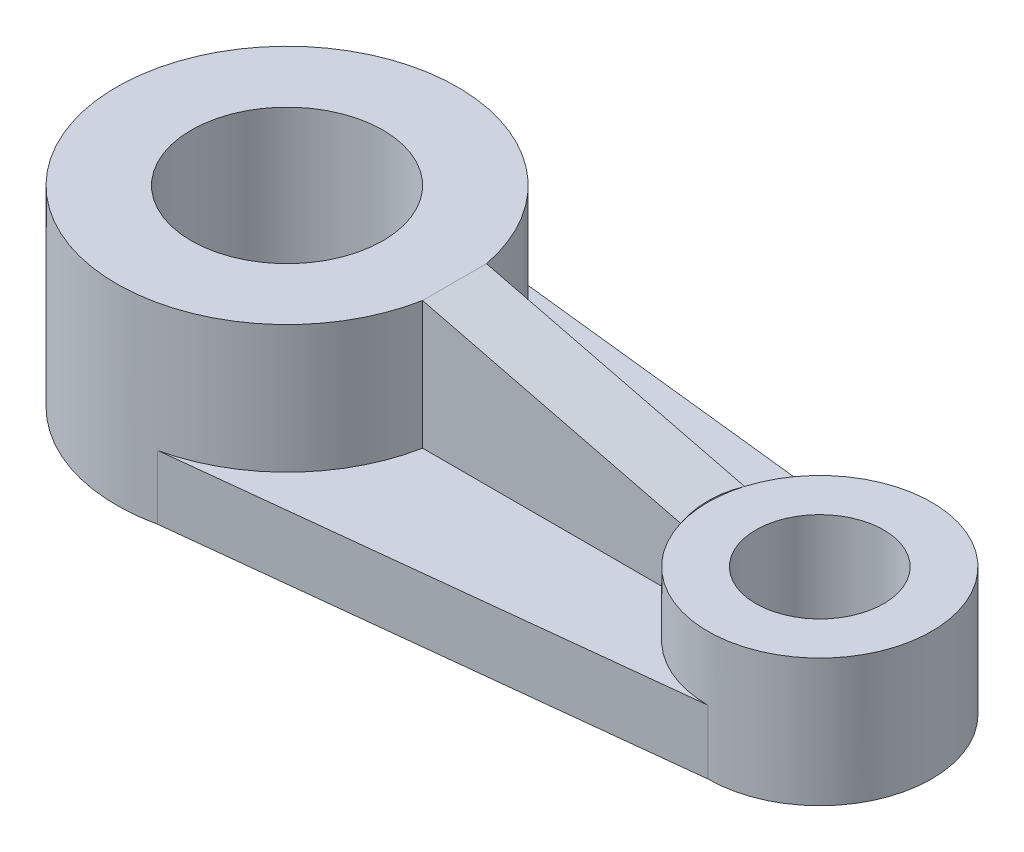
ISO-10303-21;
HEADER;
FILE_DESCRIPTION(('STEP AP214'),'2;1');
FILE_NAME('part.step','',(''),(''),'','','');
FILE_SCHEMA(('AUTOMOTIVE_DESIGN { 1 0 10303 214 1 1 1 1 }'));
ENDSEC;
DATA;
#1=APPLICATION_CONTEXT('core data for automotive mechanical design processes');
#2=APPLICATION_PROTOCOL_DEFINITION('international standard','automotive_design',2000,#1);
#3=PRODUCT_CONTEXT('',#1,'mechanical');
#4=PRODUCT('Part','Part','',(#3));
#5=PRODUCT_RELATED_PRODUCT_CATEGORY('part','',(#4));
#6=PRODUCT_DEFINITION_FORMATION('','',#4);
#7=PRODUCT_DEFINITION_CONTEXT('part definition',#1,'design');
#8=PRODUCT_DEFINITION('design','',#6,#7);
#9=PRODUCT_DEFINITION_SHAPE('','',#8);
#10=(LENGTH_UNIT() NAMED_UNIT(*) SI_UNIT(.MILLI.,.METRE.));
#11=(NAMED_UNIT(*) PLANE_ANGLE_UNIT() SI_UNIT($,.RADIAN.));
#12=(NAMED_UNIT(*) SI_UNIT($,.STERADIAN.) SOLID_ANGLE_UNIT());
#13=UNCERTAINTY_MEASURE_WITH_UNIT(LENGTH_MEASURE(1.E-05),#10,'distance_accuracy_value','');
#14=(GEOMETRIC_REPRESENTATION_CONTEXT(3) GLOBAL_UNCERTAINTY_ASSIGNED_CONTEXT((#13)) GLOBAL_UNIT_ASSIGNED_CONTEXT((#10,
#11,#12)) REPRESENTATION_CONTEXT('',''));
#15=CARTESIAN_POINT('',(0.,0.,0.));
#16=DIRECTION('',(0.,0.,1.));
#17=DIRECTION('',(1.,0.,0.));
#18=AXIS2_PLACEMENT_3D('',#15,#16,#17);
#19=CARTESIAN_POINT('',(0.,36.,0.));
#20=DIRECTION('',(0.,-1.,0.));
#21=DIRECTION('',(0.,0.,-1.));
#22=AXIS2_PLACEMENT_3D('',#19,#20,#21);
#23=CYLINDRICAL_SURFACE('',#22,32.);
#24=DIRECTION('',(0.,-1.,0.));
#25=VECTOR('',#24,1.);
#26=CARTESIAN_POINT('',(31.4324672910034,36.,6.));
#27=LINE('',#26,#25);
#28=CARTESIAN_POINT('',(31.4324672910034,36.,6.));
#29=VERTEX_POINT('',#28);
#30=CARTESIAN_POINT('',(31.4324672910034,12.,6.));
#31=VERTEX_POINT('',#30);
#32=EDGE_CURVE('E120',#29,#31,#27,.T.);
#33=ORIENTED_EDGE('',*,*,#32,.F.);
#34=CARTESIAN_POINT('',(0.,36.,0.));
#35=DIRECTION('',(0.,1.,0.));
#36=DIRECTION('',(0.,0.,1.));
#37=AXIS2_PLACEMENT_3D('',#34,#35,#36);
#38=CIRCLE('',#37,32.);
#39=CARTESIAN_POINT('',(31.4324672910034,36.,-6.));
#40=VERTEX_POINT('',#39);
#41=EDGE_CURVE('E127',#40,#29,#38,.T.);
#42=ORIENTED_EDGE('',*,*,#41,.F.);
#43=DIRECTION('',(0.,-1.,0.));
#44=VECTOR('',#43,1.);
#45=CARTESIAN_POINT('',(31.4324672910034,36.,-6.));
#46=LINE('',#45,#44);
#47=CARTESIAN_POINT('',(31.4324672910034,12.,-6.));
#48=VERTEX_POINT('',#47);
#49=EDGE_CURVE('E131',#40,#48,#46,.T.);
#50=ORIENTED_EDGE('',*,*,#49,.T.);
#51=CARTESIAN_POINT('',(0.,12.,0.));
#52=DIRECTION('',(0.,1.,0.));
#53=DIRECTION('',(0.,0.,1.));
#54=AXIS2_PLACEMENT_3D('',#51,#52,#53);
#55=CIRCLE('',#54,32.);
#56=CARTESIAN_POINT('',(6.95583440371503,12.,-31.2348582155914));
#57=VERTEX_POINT('',#56);
#58=EDGE_CURVE('E66',#48,#57,#55,.T.);
#59=ORIENTED_EDGE('',*,*,#58,.T.);
#60=DIRECTION('',(0.,-1.,0.));
#61=VECTOR('',#60,1.);
#62=CARTESIAN_POINT('',(6.95583440371503,12.,-31.2348582155914));
#63=LINE('',#62,#61);
#64=CARTESIAN_POINT('',(6.95583440371503,0.,-31.2348582155914));
#65=VERTEX_POINT('',#64);
#66=EDGE_CURVE('E150',#57,#65,#63,.T.);
#67=ORIENTED_EDGE('',*,*,#66,.T.);
#68=CARTESIAN_POINT('',(0.,0.,0.));
#69=DIRECTION('',(0.,1.,0.));
#70=DIRECTION('',(0.,0.,1.));
#71=AXIS2_PLACEMENT_3D('',#68,#69,#70);
#72=CIRCLE('',#71,32.);
#73=CARTESIAN_POINT('',(6.95583440371503,0.,31.2348582155914));
#74=VERTEX_POINT('',#73);
#75=EDGE_CURVE('E136',#65,#74,#72,.T.);
#76=ORIENTED_EDGE('',*,*,#75,.T.);
#77=DIRECTION('',(0.,-1.,0.));
#78=VECTOR('',#77,1.);
#79=CARTESIAN_POINT('',(6.95583440371503,12.,31.2348582155914));
#80=LINE('',#79,#78);
#81=CARTESIAN_POINT('',(6.95583440371503,12.,31.2348582155914));
#82=VERTEX_POINT('',#81);
#83=EDGE_CURVE('E152',#82,#74,#80,.T.);
#84=ORIENTED_EDGE('',*,*,#83,.F.);
#85=EDGE_CURVE('E129',#82,#31,#55,.T.);
#86=ORIENTED_EDGE('',*,*,#85,.T.);
#87=EDGE_LOOP('',(#33,#42,#50,#59,#67,#76,#84,#86));
#88=FACE_BOUND('',#87,.T.);
#89=ADVANCED_FACE('F45',(#88),#23,.T.);
#90=CARTESIAN_POINT('',(0.,12.,0.));
#91=DIRECTION('',(0.,1.,0.));
#92=DIRECTION('',(0.,0.,1.));
#93=AXIS2_PLACEMENT_3D('',#90,#91,#92);
#94=PLANE('',#93);
#95=CARTESIAN_POINT('',(100.,12.,0.));
#96=DIRECTION('',(0.,1.,0.));
#97=DIRECTION('',(0.,0.,1.));
#98=AXIS2_PLACEMENT_3D('',#95,#96,#97);
#99=CIRCLE('',#98,21.);
#100=CARTESIAN_POINT('',(79.8753882025019,12.,6.));
#101=VERTEX_POINT('',#100);
#102=CARTESIAN_POINT('',(100.,12.,21.));
#103=VERTEX_POINT('',#102);
#104=EDGE_CURVE('E161',#101,#103,#99,.T.);
#105=ORIENTED_EDGE('',*,*,#104,.F.);
#106=DIRECTION('',(-1.,0.,0.));
#107=VECTOR('',#106,1.);
#108=CARTESIAN_POINT('',(0.,12.,6.));
#109=LINE('',#108,#107);
#110=EDGE_CURVE('E185',#101,#31,#109,.T.);
#111=ORIENTED_EDGE('',*,*,#110,.T.);
#112=ORIENTED_EDGE('',*,*,#85,.F.);
#113=DIRECTION('',(0.994004355935433,0.,-0.109340479152898));
#114=VECTOR('',#113,1.);
#115=CARTESIAN_POINT('',(3.47791720185752,12.,31.6174291077957));
#116=LINE('',#115,#114);
#117=EDGE_CURVE('E158',#82,#103,#116,.T.);
#118=ORIENTED_EDGE('',*,*,#117,.T.);
#119=EDGE_LOOP('',(#105,#111,#112,#118));
#120=FACE_BOUND('',#119,.T.);
#121=ADVANCED_FACE('F213',(#120),#94,.T.);
#122=CARTESIAN_POINT('',(100.,24.,0.));
#123=DIRECTION('',(0.,-1.,0.));
#124=DIRECTION('',(0.,0.,-1.));
#125=AXIS2_PLACEMENT_3D('',#122,#123,#124);
#126=CYLINDRICAL_SURFACE('',#125,21.);
#127=DIRECTION('',(0.,-1.,0.));
#128=VECTOR('',#127,1.);
#129=CARTESIAN_POINT('',(79.8753882025019,24.,6.));
#130=LINE('',#129,#128);
#131=CARTESIAN_POINT('',(79.8753882025019,24.,6.));
#132=VERTEX_POINT('',#131);
#133=EDGE_CURVE('E52',#101,#132,#130,.F.);
#134=ORIENTED_EDGE('',*,*,#133,.F.);
#135=ORIENTED_EDGE('',*,*,#104,.T.);
#136=DIRECTION('',(0.,-1.,0.));
#137=VECTOR('',#136,1.);
#138=CARTESIAN_POINT('',(100.,12.,21.));
#139=LINE('',#138,#137);
#140=CARTESIAN_POINT('',(100.,0.,21.));
#141=VERTEX_POINT('',#140);
#142=EDGE_CURVE('E155',#103,#141,#139,.T.);
#143=ORIENTED_EDGE('',*,*,#142,.T.);
#144=CARTESIAN_POINT('',(100.,0.,0.));
#145=DIRECTION('',(0.,1.,0.));
#146=DIRECTION('',(0.,0.,1.));
#147=AXIS2_PLACEMENT_3D('',#144,#145,#146);
#148=CIRCLE('',#147,21.);
#149=CARTESIAN_POINT('',(100.,0.,-21.));
#150=VERTEX_POINT('',#149);
#151=EDGE_CURVE('E175',#141,#150,#148,.T.);
#152=ORIENTED_EDGE('',*,*,#151,.T.);
#153=DIRECTION('',(0.,-1.,0.));
#154=VECTOR('',#153,1.);
#155=CARTESIAN_POINT('',(100.,12.,-21.));
#156=LINE('',#155,#154);
#157=CARTESIAN_POINT('',(100.,12.,-21.));
#158=VERTEX_POINT('',#157);
#159=EDGE_CURVE('E146',#158,#150,#156,.T.);
#160=ORIENTED_EDGE('',*,*,#159,.F.);
#161=CARTESIAN_POINT('',(79.8753882025019,12.,-6.));
#162=VERTEX_POINT('',#161);
#163=EDGE_CURVE('E172',#158,#162,#99,.T.);
#164=ORIENTED_EDGE('',*,*,#163,.T.);
#165=DIRECTION('',(0.,-1.,0.));
#166=VECTOR('',#165,1.);
#167=CARTESIAN_POINT('',(79.8753882025019,24.,-6.));
#168=LINE('',#167,#166);
#169=CARTESIAN_POINT('',(79.8753882025019,24.,-6.));
#170=VERTEX_POINT('',#169);
#171=EDGE_CURVE('E135',#162,#170,#168,.F.);
#172=ORIENTED_EDGE('',*,*,#171,.T.);
#173=CARTESIAN_POINT('',(100.,24.,0.));
#174=DIRECTION('',(0.,1.,0.));
#175=DIRECTION('',(0.,0.,1.));
#176=AXIS2_PLACEMENT_3D('',#173,#174,#175);
#177=CIRCLE('',#176,21.);
#178=EDGE_CURVE('E178',#132,#170,#177,.T.);
#179=ORIENTED_EDGE('',*,*,#178,.F.);
#180=EDGE_LOOP('',(#134,#135,#143,#152,#160,#164,#172,#179));
#181=FACE_BOUND('',#180,.T.);
#182=ADVANCED_FACE('F201',(#181),#126,.T.);
#183=CARTESIAN_POINT('',(0.,36.,0.));
#184=DIRECTION('',(0.,1.,0.));
#185=DIRECTION('',(0.,0.,1.));
#186=AXIS2_PLACEMENT_3D('',#183,#184,#185);
#187=PLANE('',#186);
#188=DIRECTION('',(0.,0.,1.));
#189=VECTOR('',#188,1.);
#190=CARTESIAN_POINT('',(31.4324672910034,36.,-26.));
#191=LINE('',#190,#189);
#192=EDGE_CURVE('E108',#40,#29,#191,.T.);
#193=ORIENTED_EDGE('',*,*,#192,.F.);
#194=ORIENTED_EDGE('',*,*,#41,.T.);
#195=EDGE_LOOP('',(#193,#194));
#196=FACE_BOUND('',#195,.T.);
#197=CARTESIAN_POINT('',(0.,36.,0.));
#198=DIRECTION('',(0.,1.,0.));
#199=DIRECTION('',(0.,0.,1.));
#200=AXIS2_PLACEMENT_3D('',#197,#198,#199);
#201=CIRCLE('',#200,18.);
#202=CARTESIAN_POINT('',(0.,36.,18.));
#203=VERTEX_POINT('',#202);
#204=EDGE_CURVE('E140',#203,#203,#201,.T.);
#205=ORIENTED_EDGE('',*,*,#204,.F.);
#206=EDGE_LOOP('',(#205));
#207=FACE_BOUND('',#206,.T.);
#208=ADVANCED_FACE('F133',(#196,#207),#187,.T.);
#209=CARTESIAN_POINT('',(0.,0.,0.));
#210=DIRECTION('',(0.,1.,0.));
#211=DIRECTION('',(0.,0.,1.));
#212=AXIS2_PLACEMENT_3D('',#209,#210,#211);
#213=PLANE('',#212);
#214=ORIENTED_EDGE('',*,*,#75,.F.);
#215=DIRECTION('',(0.994004355935433,0.,0.109340479152898));
#216=VECTOR('',#215,1.);
#217=CARTESIAN_POINT('',(3.47791720185752,0.,-31.6174291077957));
#218=LINE('',#217,#216);
#219=EDGE_CURVE('E162',#65,#150,#218,.T.);
#220=ORIENTED_EDGE('',*,*,#219,.T.);
#221=ORIENTED_EDGE('',*,*,#151,.F.);
#222=DIRECTION('',(0.994004355935433,0.,-0.109340479152898));
#223=VECTOR('',#222,1.);
#224=CARTESIAN_POINT('',(3.47791720185752,0.,31.6174291077957));
#225=LINE('',#224,#223);
#226=EDGE_CURVE('E159',#74,#141,#225,.T.);
#227=ORIENTED_EDGE('',*,*,#226,.F.);
#228=EDGE_LOOP('',(#214,#220,#221,#227));
#229=FACE_BOUND('',#228,.T.);
#230=CARTESIAN_POINT('',(0.,0.,0.));
#231=DIRECTION('',(0.,1.,0.));
#232=DIRECTION('',(0.,0.,1.));
#233=AXIS2_PLACEMENT_3D('',#230,#231,#232);
#234=CIRCLE('',#233,18.);
#235=CARTESIAN_POINT('',(0.,0.,18.));
#236=VERTEX_POINT('',#235);
#237=EDGE_CURVE('E143',#236,#236,#234,.T.);
#238=ORIENTED_EDGE('',*,*,#237,.T.);
#239=EDGE_LOOP('',(#238));
#240=FACE_BOUND('',#239,.T.);
#241=CARTESIAN_POINT('',(100.,0.,0.));
#242=DIRECTION('',(0.,1.,0.));
#243=DIRECTION('',(0.,0.,1.));
#244=AXIS2_PLACEMENT_3D('',#241,#242,#243);
#245=CIRCLE('',#244,12.);
#246=CARTESIAN_POINT('',(100.,0.,12.));
#247=VERTEX_POINT('',#246);
#248=EDGE_CURVE('E182',#247,#247,#245,.T.);
#249=ORIENTED_EDGE('',*,*,#248,.T.);
#250=EDGE_LOOP('',(#249));
#251=FACE_BOUND('',#250,.T.);
#252=ADVANCED_FACE('F206',(#229,#240,#251),#213,.F.);
#253=CARTESIAN_POINT('',(0.,36.,0.));
#254=DIRECTION('',(0.,-1.,0.));
#255=DIRECTION('',(0.,0.,-1.));
#256=AXIS2_PLACEMENT_3D('',#253,#254,#255);
#257=CYLINDRICAL_SURFACE('',#256,18.);
#258=ORIENTED_EDGE('',*,*,#204,.T.);
#259=EDGE_LOOP('',(#258));
#260=FACE_BOUND('',#259,.T.);
#261=ORIENTED_EDGE('',*,*,#237,.F.);
#262=EDGE_LOOP('',(#261));
#263=FACE_BOUND('',#262,.T.);
#264=ADVANCED_FACE('F250',(#260,#263),#257,.F.);
#265=CARTESIAN_POINT('',(3.47791720185752,12.,-31.6174291077957));
#266=DIRECTION('',(0.109340479152898,0.,-0.994004355935433));
#267=DIRECTION('',(-0.994004355935433,0.,-0.109340479152898));
#268=AXIS2_PLACEMENT_3D('',#265,#266,#267);
#269=PLANE('',#268);
#270=ORIENTED_EDGE('',*,*,#219,.F.);
#271=ORIENTED_EDGE('',*,*,#66,.F.);
#272=DIRECTION('',(0.994004355935433,0.,0.109340479152898));
#273=VECTOR('',#272,1.);
#274=CARTESIAN_POINT('',(3.47791720185752,12.,-31.6174291077957));
#275=LINE('',#274,#273);
#276=EDGE_CURVE('E169',#57,#158,#275,.T.);
#277=ORIENTED_EDGE('',*,*,#276,.T.);
#278=ORIENTED_EDGE('',*,*,#159,.T.);
#279=EDGE_LOOP('',(#270,#271,#277,#278));
#280=FACE_BOUND('',#279,.T.);
#281=ADVANCED_FACE('F199',(#280),#269,.T.);
#282=CARTESIAN_POINT('',(3.47791720185752,12.,31.6174291077957));
#283=DIRECTION('',(-0.109340479152898,0.,-0.994004355935433));
#284=DIRECTION('',(-0.994004355935433,0.,0.109340479152898));
#285=AXIS2_PLACEMENT_3D('',#282,#283,#284);
#286=PLANE('',#285);
#287=ORIENTED_EDGE('',*,*,#226,.T.);
#288=ORIENTED_EDGE('',*,*,#142,.F.);
#289=ORIENTED_EDGE('',*,*,#117,.F.);
#290=ORIENTED_EDGE('',*,*,#83,.T.);
#291=EDGE_LOOP('',(#287,#288,#289,#290));
#292=FACE_BOUND('',#291,.T.);
#293=ADVANCED_FACE('F210',(#292),#286,.F.);
#294=DIRECTION('',(-1.,0.,0.));
#295=VECTOR('',#294,1.);
#296=CARTESIAN_POINT('',(0.,12.,-6.));
#297=LINE('',#296,#295);
#298=EDGE_CURVE('E130',#162,#48,#297,.T.);
#299=ORIENTED_EDGE('',*,*,#298,.F.);
#300=ORIENTED_EDGE('',*,*,#163,.F.);
#301=ORIENTED_EDGE('',*,*,#276,.F.);
#302=ORIENTED_EDGE('',*,*,#58,.F.);
#303=EDGE_LOOP('',(#299,#300,#301,#302));
#304=FACE_BOUND('',#303,.T.);
#305=ADVANCED_FACE('F195',(#304),#94,.T.);
#306=CARTESIAN_POINT('',(100.,24.,0.));
#307=DIRECTION('',(0.,1.,0.));
#308=DIRECTION('',(0.,0.,1.));
#309=AXIS2_PLACEMENT_3D('',#306,#307,#308);
#310=PLANE('',#309);
#311=EDGE_CURVE('E165',#170,#132,#177,.T.);
#312=ORIENTED_EDGE('',*,*,#311,.T.);
#313=ORIENTED_EDGE('',*,*,#178,.T.);
#314=EDGE_LOOP('',(#312,#313));
#315=FACE_BOUND('',#314,.T.);
#316=CARTESIAN_POINT('',(100.,24.,0.));
#317=DIRECTION('',(0.,1.,0.));
#318=DIRECTION('',(0.,0.,1.));
#319=AXIS2_PLACEMENT_3D('',#316,#317,#318);
#320=CIRCLE('',#319,12.);
#321=CARTESIAN_POINT('',(100.,24.,12.));
#322=VERTEX_POINT('',#321);
#323=EDGE_CURVE('E179',#322,#322,#320,.T.);
#324=ORIENTED_EDGE('',*,*,#323,.F.);
#325=EDGE_LOOP('',(#324));
#326=FACE_BOUND('',#325,.T.);
#327=ADVANCED_FACE('F217',(#315,#326),#310,.T.);
#328=CARTESIAN_POINT('',(100.,24.,0.));
#329=DIRECTION('',(0.,-1.,0.));
#330=DIRECTION('',(0.,0.,-1.));
#331=AXIS2_PLACEMENT_3D('',#328,#329,#330);
#332=CYLINDRICAL_SURFACE('',#331,12.);
#333=ORIENTED_EDGE('',*,*,#323,.T.);
#334=EDGE_LOOP('',(#333));
#335=FACE_BOUND('',#334,.T.);
#336=ORIENTED_EDGE('',*,*,#248,.F.);
#337=EDGE_LOOP('',(#336));
#338=FACE_BOUND('',#337,.T.);
#339=ADVANCED_FACE('F229',(#335,#338),#332,.F.);
#340=CARTESIAN_POINT('',(31.4324672910034,36.,6.));
#341=DIRECTION('',(0.,0.,-1.));
#342=DIRECTION('',(-1.,0.,0.));
#343=AXIS2_PLACEMENT_3D('',#340,#341,#342);
#344=PLANE('',#343);
#345=ORIENTED_EDGE('',*,*,#133,.T.);
#346=DIRECTION('',(0.970662306335225,-0.240446848721253,0.));
#347=VECTOR('',#346,1.);
#348=CARTESIAN_POINT('',(79.8753882025019,24.,6.));
#349=LINE('',#348,#347);
#350=EDGE_CURVE('E111',#29,#132,#349,.T.);
#351=ORIENTED_EDGE('',*,*,#350,.F.);
#352=ORIENTED_EDGE('',*,*,#32,.T.);
#353=ORIENTED_EDGE('',*,*,#110,.F.);
#354=EDGE_LOOP('',(#345,#351,#352,#353));
#355=FACE_BOUND('',#354,.T.);
#356=ADVANCED_FACE('F119',(#355),#344,.F.);
#357=CARTESIAN_POINT('',(100.,36.,0.));
#358=DIRECTION('',(0.,-1.,0.));
#359=DIRECTION('',(0.,0.,-1.));
#360=AXIS2_PLACEMENT_3D('',#357,#358,#359);
#361=CYLINDRICAL_SURFACE('',#360,21.);
#362=CARTESIAN_POINT('',(100.,19.0148476387051,0.));
#363=DIRECTION('',(-0.240446848721253,-0.970662306335225,0.));
#364=DIRECTION('',(0.970662306335225,-0.240446848721253,0.));
#365=AXIS2_PLACEMENT_3D('',#362,#363,#364);
#366=ELLIPSE('',#365,21.6347125699012,21.);
#367=EDGE_CURVE('E58',#132,#170,#366,.T.);
#368=ORIENTED_EDGE('',*,*,#367,.F.);
#369=ORIENTED_EDGE('',*,*,#311,.F.);
#370=EDGE_LOOP('',(#368,#369));
#371=FACE_BOUND('',#370,.T.);
#372=ADVANCED_FACE('F220',(#371),#361,.F.);
#373=CARTESIAN_POINT('',(31.4324672910034,36.,-6.));
#374=DIRECTION('',(0.,0.,-1.));
#375=DIRECTION('',(-1.,0.,0.));
#376=AXIS2_PLACEMENT_3D('',#373,#374,#375);
#377=PLANE('',#376);
#378=DIRECTION('',(-0.970662306335225,0.240446848721253,0.));
#379=VECTOR('',#378,1.);
#380=CARTESIAN_POINT('',(31.4324672910034,36.,-6.));
#381=LINE('',#380,#379);
#382=EDGE_CURVE('E12',#170,#40,#381,.T.);
#383=ORIENTED_EDGE('',*,*,#382,.F.);
#384=ORIENTED_EDGE('',*,*,#171,.F.);
#385=ORIENTED_EDGE('',*,*,#298,.T.);
#386=ORIENTED_EDGE('',*,*,#49,.F.);
#387=EDGE_LOOP('',(#383,#384,#385,#386));
#388=FACE_BOUND('',#387,.T.);
#389=ADVANCED_FACE('F222',(#388),#377,.T.);
#390=CARTESIAN_POINT('',(79.8753882025019,24.,-26.));
#391=DIRECTION('',(-0.240446848721253,-0.970662306335225,0.));
#392=DIRECTION('',(0.970662306335225,-0.240446848721253,0.));
#393=AXIS2_PLACEMENT_3D('',#390,#391,#392);
#394=PLANE('',#393);
#395=ORIENTED_EDGE('',*,*,#367,.T.);
#396=ORIENTED_EDGE('',*,*,#382,.T.);
#397=ORIENTED_EDGE('',*,*,#192,.T.);
#398=ORIENTED_EDGE('',*,*,#350,.T.);
#399=EDGE_LOOP('',(#395,#396,#397,#398));
#400=FACE_BOUND('',#399,.T.);
#401=ADVANCED_FACE('F110',(#400),#394,.F.);
#402=CLOSED_SHELL('',(#89,#121,#182,#208,#252,#264,#281,#293,#305,#327,#339,#356,#372,#389,#401));
#403=MANIFOLD_SOLID_BREP('B2',#402);
#404=ADVANCED_BREP_SHAPE_REPRESENTATION('',(#18,#403),#14);
#405=SHAPE_DEFINITION_REPRESENTATION(#9,#404);
ENDSEC;
END-ISO-10303-21;
